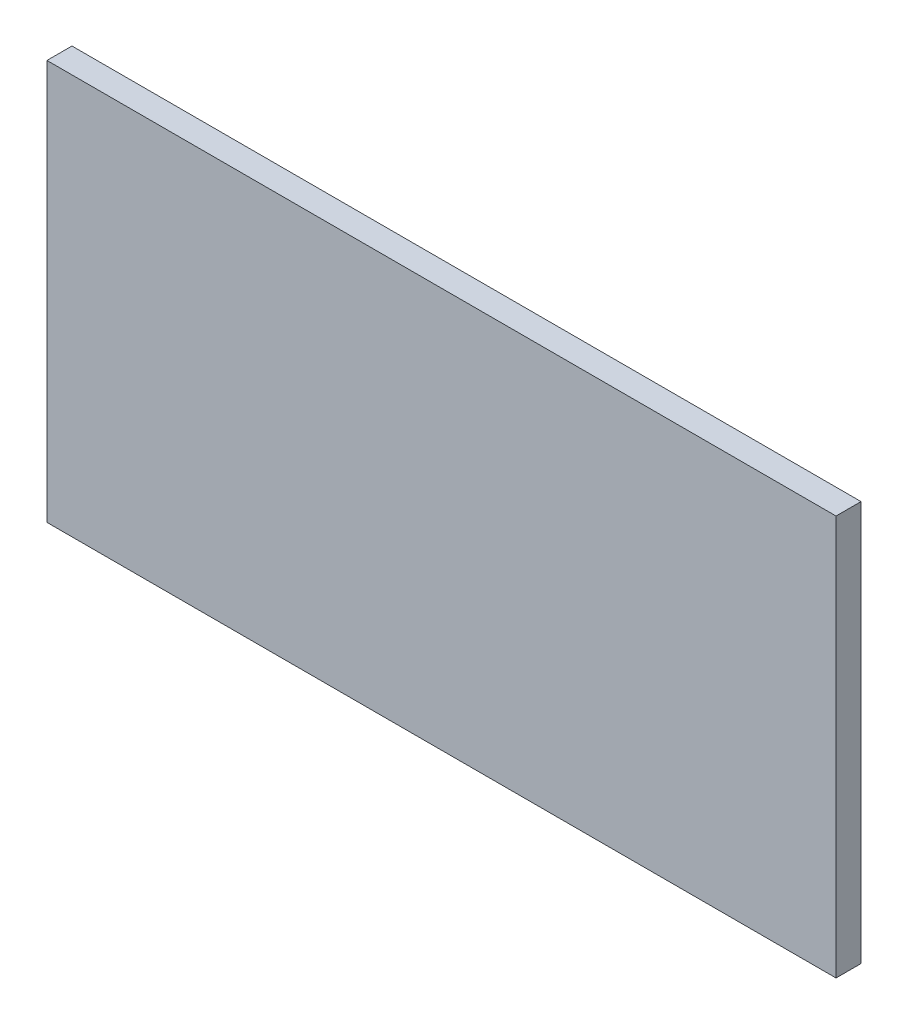
ISO-10303-21;
HEADER;
FILE_DESCRIPTION(('STEP AP214'),'2;1');
FILE_NAME('part.step','',(''),(''),'','','');
FILE_SCHEMA(('AUTOMOTIVE_DESIGN { 1 0 10303 214 1 1 1 1 }'));
ENDSEC;
DATA;
#1=APPLICATION_CONTEXT('core data for automotive mechanical design processes');
#2=APPLICATION_PROTOCOL_DEFINITION('international standard','automotive_design',2000,#1);
#3=PRODUCT_CONTEXT('',#1,'mechanical');
#4=PRODUCT('Part','Part','',(#3));
#5=PRODUCT_RELATED_PRODUCT_CATEGORY('part','',(#4));
#6=PRODUCT_DEFINITION_FORMATION('','',#4);
#7=PRODUCT_DEFINITION_CONTEXT('part definition',#1,'design');
#8=PRODUCT_DEFINITION('design','',#6,#7);
#9=PRODUCT_DEFINITION_SHAPE('','',#8);
#10=(LENGTH_UNIT() NAMED_UNIT(*) SI_UNIT(.MILLI.,.METRE.));
#11=(NAMED_UNIT(*) PLANE_ANGLE_UNIT() SI_UNIT($,.RADIAN.));
#12=(NAMED_UNIT(*) SI_UNIT($,.STERADIAN.) SOLID_ANGLE_UNIT());
#13=UNCERTAINTY_MEASURE_WITH_UNIT(LENGTH_MEASURE(1.E-05),#10,'distance_accuracy_value','');
#14=(GEOMETRIC_REPRESENTATION_CONTEXT(3) GLOBAL_UNCERTAINTY_ASSIGNED_CONTEXT((#13)) GLOBAL_UNIT_ASSIGNED_CONTEXT((#10,
#11,#12)) REPRESENTATION_CONTEXT('',''));
#15=CARTESIAN_POINT('',(0.,0.,0.));
#16=DIRECTION('',(0.,0.,1.));
#17=DIRECTION('',(1.,0.,0.));
#18=AXIS2_PLACEMENT_3D('',#15,#16,#17);
#19=CARTESIAN_POINT('',(-284.,-144.,18.));
#20=DIRECTION('',(1.,0.,0.));
#21=DIRECTION('',(0.,0.,-1.));
#22=AXIS2_PLACEMENT_3D('',#19,#20,#21);
#23=PLANE('',#22);
#24=DIRECTION('',(0.,-1.,0.));
#25=VECTOR('',#24,1.);
#26=CARTESIAN_POINT('',(-284.,-144.,0.));
#27=LINE('',#26,#25);
#28=CARTESIAN_POINT('',(-284.,144.,0.));
#29=VERTEX_POINT('',#28);
#30=CARTESIAN_POINT('',(-284.,-144.,0.));
#31=VERTEX_POINT('',#30);
#32=EDGE_CURVE('E96',#29,#31,#27,.T.);
#33=ORIENTED_EDGE('',*,*,#32,.T.);
#34=DIRECTION('',(0.,0.,-1.));
#35=VECTOR('',#34,1.);
#36=CARTESIAN_POINT('',(-284.,-144.,18.));
#37=LINE('',#36,#35);
#38=CARTESIAN_POINT('',(-284.,-144.,18.));
#39=VERTEX_POINT('',#38);
#40=EDGE_CURVE('E11',#39,#31,#37,.T.);
#41=ORIENTED_EDGE('',*,*,#40,.F.);
#42=DIRECTION('',(0.,-1.,0.));
#43=VECTOR('',#42,1.);
#44=CARTESIAN_POINT('',(-284.,-144.,18.));
#45=LINE('',#44,#43);
#46=CARTESIAN_POINT('',(-284.,144.,18.));
#47=VERTEX_POINT('',#46);
#48=EDGE_CURVE('E84',#47,#39,#45,.T.);
#49=ORIENTED_EDGE('',*,*,#48,.F.);
#50=DIRECTION('',(0.,0.,-1.));
#51=VECTOR('',#50,1.);
#52=CARTESIAN_POINT('',(-284.,144.,18.));
#53=LINE('',#52,#51);
#54=EDGE_CURVE('E92',#47,#29,#53,.T.);
#55=ORIENTED_EDGE('',*,*,#54,.T.);
#56=EDGE_LOOP('',(#33,#41,#49,#55));
#57=FACE_BOUND('',#56,.T.);
#58=ADVANCED_FACE('F33',(#57),#23,.F.);
#59=CARTESIAN_POINT('',(284.,-144.,18.));
#60=DIRECTION('',(0.,1.,0.));
#61=DIRECTION('',(-1.,0.,0.));
#62=AXIS2_PLACEMENT_3D('',#59,#60,#61);
#63=PLANE('',#62);
#64=DIRECTION('',(1.,0.,0.));
#65=VECTOR('',#64,1.);
#66=CARTESIAN_POINT('',(284.,-144.,0.));
#67=LINE('',#66,#65);
#68=CARTESIAN_POINT('',(284.,-144.,0.));
#69=VERTEX_POINT('',#68);
#70=EDGE_CURVE('E88',#31,#69,#67,.T.);
#71=ORIENTED_EDGE('',*,*,#70,.T.);
#72=DIRECTION('',(0.,0.,-1.));
#73=VECTOR('',#72,1.);
#74=CARTESIAN_POINT('',(284.,-144.,18.));
#75=LINE('',#74,#73);
#76=CARTESIAN_POINT('',(284.,-144.,18.));
#77=VERTEX_POINT('',#76);
#78=EDGE_CURVE('E41',#77,#69,#75,.T.);
#79=ORIENTED_EDGE('',*,*,#78,.F.);
#80=DIRECTION('',(1.,0.,0.));
#81=VECTOR('',#80,1.);
#82=CARTESIAN_POINT('',(284.,-144.,18.));
#83=LINE('',#82,#81);
#84=EDGE_CURVE('E79',#39,#77,#83,.T.);
#85=ORIENTED_EDGE('',*,*,#84,.F.);
#86=ORIENTED_EDGE('',*,*,#40,.T.);
#87=EDGE_LOOP('',(#71,#79,#85,#86));
#88=FACE_BOUND('',#87,.T.);
#89=ADVANCED_FACE('F87',(#88),#63,.F.);
#90=CARTESIAN_POINT('',(284.,-144.,18.));
#91=DIRECTION('',(-1.,0.,0.));
#92=DIRECTION('',(0.,0.,1.));
#93=AXIS2_PLACEMENT_3D('',#90,#91,#92);
#94=PLANE('',#93);
#95=DIRECTION('',(0.,1.,0.));
#96=VECTOR('',#95,1.);
#97=CARTESIAN_POINT('',(284.,-144.,0.));
#98=LINE('',#97,#96);
#99=CARTESIAN_POINT('',(284.,144.,0.));
#100=VERTEX_POINT('',#99);
#101=EDGE_CURVE('E66',#69,#100,#98,.T.);
#102=ORIENTED_EDGE('',*,*,#101,.T.);
#103=DIRECTION('',(0.,0.,-1.));
#104=VECTOR('',#103,1.);
#105=CARTESIAN_POINT('',(284.,144.,18.));
#106=LINE('',#105,#104);
#107=CARTESIAN_POINT('',(284.,144.,18.));
#108=VERTEX_POINT('',#107);
#109=EDGE_CURVE('E89',#108,#100,#106,.T.);
#110=ORIENTED_EDGE('',*,*,#109,.F.);
#111=DIRECTION('',(0.,1.,0.));
#112=VECTOR('',#111,1.);
#113=CARTESIAN_POINT('',(284.,-144.,18.));
#114=LINE('',#113,#112);
#115=EDGE_CURVE('E82',#77,#108,#114,.T.);
#116=ORIENTED_EDGE('',*,*,#115,.F.);
#117=ORIENTED_EDGE('',*,*,#78,.T.);
#118=EDGE_LOOP('',(#102,#110,#116,#117));
#119=FACE_BOUND('',#118,.T.);
#120=ADVANCED_FACE('F90',(#119),#94,.F.);
#121=CARTESIAN_POINT('',(284.,144.,18.));
#122=DIRECTION('',(0.,-1.,0.));
#123=DIRECTION('',(1.,0.,0.));
#124=AXIS2_PLACEMENT_3D('',#121,#122,#123);
#125=PLANE('',#124);
#126=DIRECTION('',(-1.,0.,0.));
#127=VECTOR('',#126,1.);
#128=CARTESIAN_POINT('',(284.,144.,0.));
#129=LINE('',#128,#127);
#130=EDGE_CURVE('E72',#100,#29,#129,.T.);
#131=ORIENTED_EDGE('',*,*,#130,.T.);
#132=ORIENTED_EDGE('',*,*,#54,.F.);
#133=DIRECTION('',(-1.,0.,0.));
#134=VECTOR('',#133,1.);
#135=CARTESIAN_POINT('',(284.,144.,18.));
#136=LINE('',#135,#134);
#137=EDGE_CURVE('E49',#108,#47,#136,.T.);
#138=ORIENTED_EDGE('',*,*,#137,.F.);
#139=ORIENTED_EDGE('',*,*,#109,.T.);
#140=EDGE_LOOP('',(#131,#132,#138,#139));
#141=FACE_BOUND('',#140,.T.);
#142=ADVANCED_FACE('F103',(#141),#125,.F.);
#143=CARTESIAN_POINT('',(0.,0.,18.));
#144=DIRECTION('',(0.,0.,1.));
#145=DIRECTION('',(1.,0.,0.));
#146=AXIS2_PLACEMENT_3D('',#143,#144,#145);
#147=PLANE('',#146);
#148=ORIENTED_EDGE('',*,*,#48,.T.);
#149=ORIENTED_EDGE('',*,*,#84,.T.);
#150=ORIENTED_EDGE('',*,*,#115,.T.);
#151=ORIENTED_EDGE('',*,*,#137,.T.);
#152=EDGE_LOOP('',(#148,#149,#150,#151));
#153=FACE_BOUND('',#152,.T.);
#154=ADVANCED_FACE('F80',(#153),#147,.T.);
#155=CARTESIAN_POINT('',(0.,0.,0.));
#156=DIRECTION('',(0.,0.,1.));
#157=DIRECTION('',(1.,0.,0.));
#158=AXIS2_PLACEMENT_3D('',#155,#156,#157);
#159=PLANE('',#158);
#160=ORIENTED_EDGE('',*,*,#32,.F.);
#161=ORIENTED_EDGE('',*,*,#130,.F.);
#162=ORIENTED_EDGE('',*,*,#101,.F.);
#163=ORIENTED_EDGE('',*,*,#70,.F.);
#164=EDGE_LOOP('',(#160,#161,#162,#163));
#165=FACE_BOUND('',#164,.T.);
#166=ADVANCED_FACE('F106',(#165),#159,.F.);
#167=CLOSED_SHELL('',(#58,#89,#120,#142,#154,#166));
#168=MANIFOLD_SOLID_BREP('B2',#167);
#169=ADVANCED_BREP_SHAPE_REPRESENTATION('',(#18,#168),#14);
#170=SHAPE_DEFINITION_REPRESENTATION(#9,#169);
ENDSEC;
END-ISO-10303-21;
